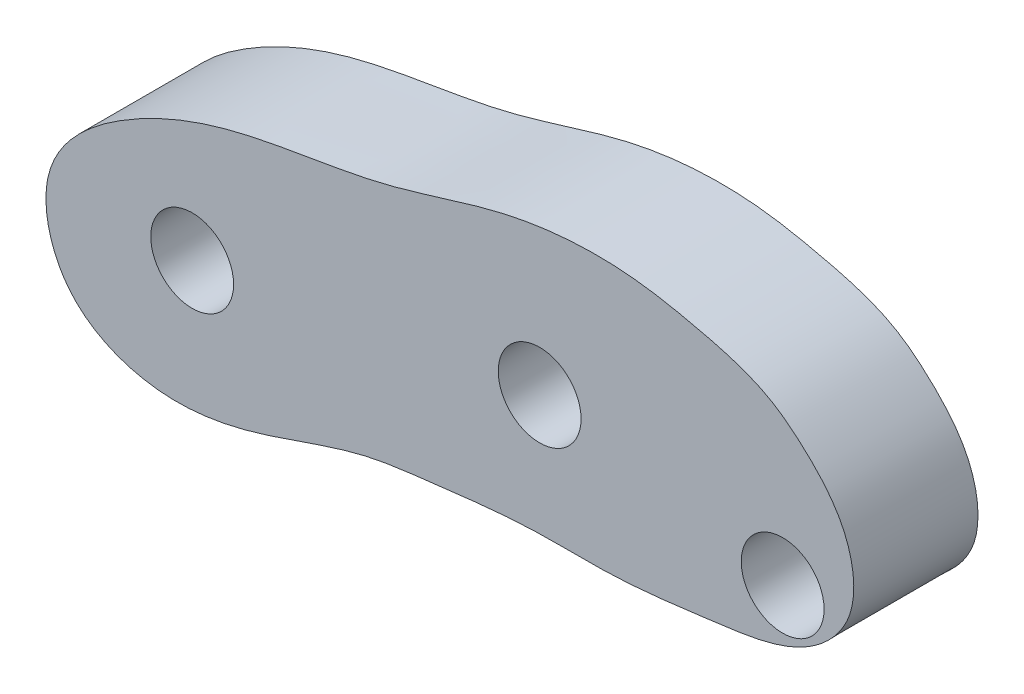
ISO-10303-21;
HEADER;
FILE_DESCRIPTION(('STEP AP214'),'2;1');
FILE_NAME('part.step','',(''),(''),'','','');
FILE_SCHEMA(('AUTOMOTIVE_DESIGN { 1 0 10303 214 1 1 1 1 }'));
ENDSEC;
DATA;
#1=APPLICATION_CONTEXT('core data for automotive mechanical design processes');
#2=APPLICATION_PROTOCOL_DEFINITION('international standard','automotive_design',2000,#1);
#3=PRODUCT_CONTEXT('',#1,'mechanical');
#4=PRODUCT('Part','Part','',(#3));
#5=PRODUCT_RELATED_PRODUCT_CATEGORY('part','',(#4));
#6=PRODUCT_DEFINITION_FORMATION('','',#4);
#7=PRODUCT_DEFINITION_CONTEXT('part definition',#1,'design');
#8=PRODUCT_DEFINITION('design','',#6,#7);
#9=PRODUCT_DEFINITION_SHAPE('','',#8);
#10=(LENGTH_UNIT() NAMED_UNIT(*) SI_UNIT(.MILLI.,.METRE.));
#11=(NAMED_UNIT(*) PLANE_ANGLE_UNIT() SI_UNIT($,.RADIAN.));
#12=(NAMED_UNIT(*) SI_UNIT($,.STERADIAN.) SOLID_ANGLE_UNIT());
#13=UNCERTAINTY_MEASURE_WITH_UNIT(LENGTH_MEASURE(1.E-05),#10,'distance_accuracy_value','');
#14=(GEOMETRIC_REPRESENTATION_CONTEXT(3) GLOBAL_UNCERTAINTY_ASSIGNED_CONTEXT((#13)) GLOBAL_UNIT_ASSIGNED_CONTEXT((#10,
#11,#12)) REPRESENTATION_CONTEXT('',''));
#15=CARTESIAN_POINT('',(0.,0.,0.));
#16=DIRECTION('',(0.,0.,1.));
#17=DIRECTION('',(1.,0.,0.));
#18=AXIS2_PLACEMENT_3D('',#15,#16,#17);
#19=CARTESIAN_POINT('',(2.38130786974085,11.6572512808231,3.));
#20=DIRECTION('',(0.,0.,1.));
#21=DIRECTION('',(1.,0.,0.));
#22=AXIS2_PLACEMENT_3D('',#19,#20,#21);
#23=PLANE('',#22);
#24=CARTESIAN_POINT('',(-5.20303399282698,11.9286291476342,3.));
#25=DIRECTION('',(0.,0.,1.));
#26=DIRECTION('',(1.,0.,0.));
#27=AXIS2_PLACEMENT_3D('',#24,#25,#26);
#28=CIRCLE('',#27,1.);
#29=CARTESIAN_POINT('',(-4.20303399282697,11.9286291476342,3.));
#30=VERTEX_POINT('',#29);
#31=EDGE_CURVE('E90',#30,#30,#28,.T.);
#32=ORIENTED_EDGE('',*,*,#31,.F.);
#33=EDGE_LOOP('',(#32));
#34=FACE_BOUND('',#33,.T.);
#35=CARTESIAN_POINT('',(-17.0747401229307,10.5462096882409,3.));
#36=CARTESIAN_POINT('',(-16.8697917913703,11.495190399688,3.));
#37=CARTESIAN_POINT('',(-15.1890375803473,12.8841945451084,3.));
#38=CARTESIAN_POINT('',(-12.3116392034365,13.9653363005591,3.));
#39=CARTESIAN_POINT('',(-9.11269658642386,14.2736370660728,3.));
#40=CARTESIAN_POINT('',(-5.98809239092924,15.4672154884498,3.));
#41=CARTESIAN_POINT('',(-3.36412085059592,15.6452678244348,3.));
#42=CARTESIAN_POINT('',(-1.2088136536674,15.1992425079085,3.));
#43=CARTESIAN_POINT('',(0.193260383925238,14.8288844683819,3.));
#44=CARTESIAN_POINT('',(1.36526609501103,13.8719138918235,3.));
#45=CARTESIAN_POINT('',(2.31666838197321,12.8083539661806,3.));
#46=CARTESIAN_POINT('',(2.52684130779453,11.0507906828682,3.));
#47=CARTESIAN_POINT('',(1.1518851741317,9.5610393349551,3.));
#48=CARTESIAN_POINT('',(-1.02647016912803,9.29783091717382,3.));
#49=CARTESIAN_POINT('',(-3.27833763877944,8.98678059701643,3.));
#50=CARTESIAN_POINT('',(-5.5579418542124,9.07595140802805,3.));
#51=CARTESIAN_POINT('',(-7.51144407818619,8.8226515013268,3.));
#52=CARTESIAN_POINT('',(-9.82392607886792,8.56849595241855,3.));
#53=CARTESIAN_POINT('',(-11.9834347086286,7.6072675304707,3.));
#54=CARTESIAN_POINT('',(-14.55088630155,7.22008490306595,3.));
#55=CARTESIAN_POINT('',(-16.8110313781361,8.1990800918358,3.));
#56=CARTESIAN_POINT('',(-17.2264452191954,9.84376332487068,3.));
#57=CARTESIAN_POINT('',(-17.0747401229307,10.5462096882409,3.));
#58=B_SPLINE_CURVE_WITH_KNOTS('',3,(#35,#36,#37,#38,#39,#40,#41,#42,#43,#44,#45,#46,#47,#48,#49,
#50,#51,#52,#53,#54,#55,#56,#57),.UNSPECIFIED.,.T.,.F.,(4,1,1,1,1,1,1,1,1,1,1,1,1,1,1,1,1,1,1,1,
4),(0.,0.0647341060027587,0.12580922284578,0.207281305339162,0.274075055569297,
0.347051231572845,0.376812323095858,0.420550281557063,0.44049444708881,0.476416641659934,
0.513364335776372,0.545183570499756,0.599503304108211,0.65312759135863,0.69720555797968,
0.749778400728776,0.78374903802129,0.850663977568499,0.905143138354099,0.952083075241524,1.),.UNSPECIFIED.);
#59=CARTESIAN_POINT('',(-17.0747401229307,10.5462096882409,3.));
#60=VERTEX_POINT('',#59);
#61=EDGE_CURVE('E11',#60,#60,#58,.T.);
#62=ORIENTED_EDGE('',*,*,#61,.F.);
#63=EDGE_LOOP('',(#62));
#64=FACE_BOUND('',#63,.T.);
#65=CARTESIAN_POINT('',(-13.5930830410716,10.5462096882409,3.));
#66=DIRECTION('',(0.,0.,1.));
#67=DIRECTION('',(1.,0.,0.));
#68=AXIS2_PLACEMENT_3D('',#65,#66,#67);
#69=CIRCLE('',#68,1.);
#70=CARTESIAN_POINT('',(-12.5930830410716,10.5462096882409,3.));
#71=VERTEX_POINT('',#70);
#72=EDGE_CURVE('E79',#71,#71,#69,.T.);
#73=ORIENTED_EDGE('',*,*,#72,.F.);
#74=EDGE_LOOP('',(#73));
#75=FACE_BOUND('',#74,.T.);
#76=CARTESIAN_POINT('',(0.664508578928438,10.8833004614541,3.));
#77=DIRECTION('',(0.,0.,1.));
#78=DIRECTION('',(1.,0.,0.));
#79=AXIS2_PLACEMENT_3D('',#76,#77,#78);
#80=CIRCLE('',#79,0.999999999999998);
#81=CARTESIAN_POINT('',(1.66450857892844,10.8833004614541,3.));
#82=VERTEX_POINT('',#81);
#83=EDGE_CURVE('E96',#82,#82,#80,.T.);
#84=ORIENTED_EDGE('',*,*,#83,.F.);
#85=EDGE_LOOP('',(#84));
#86=FACE_BOUND('',#85,.T.);
#87=ADVANCED_FACE('F66',(#34,#64,#75,#86),#23,.T.);
#88=CARTESIAN_POINT('',(2.38130786974085,11.6572512808231,0.));
#89=DIRECTION('',(0.,0.,1.));
#90=DIRECTION('',(1.,0.,0.));
#91=AXIS2_PLACEMENT_3D('',#88,#89,#90);
#92=PLANE('',#91);
#93=CARTESIAN_POINT('',(-17.0747401229307,10.5462096882409,0.));
#94=CARTESIAN_POINT('',(-16.8697917913703,11.495190399688,0.));
#95=CARTESIAN_POINT('',(-15.1890375803473,12.8841945451084,0.));
#96=CARTESIAN_POINT('',(-12.3116392034365,13.9653363005591,0.));
#97=CARTESIAN_POINT('',(-9.11269658642386,14.2736370660728,0.));
#98=CARTESIAN_POINT('',(-5.98809239092924,15.4672154884498,0.));
#99=CARTESIAN_POINT('',(-3.36412085059592,15.6452678244348,0.));
#100=CARTESIAN_POINT('',(-1.2088136536674,15.1992425079085,0.));
#101=CARTESIAN_POINT('',(0.193260383925238,14.8288844683819,0.));
#102=CARTESIAN_POINT('',(1.36526609501103,13.8719138918235,0.));
#103=CARTESIAN_POINT('',(2.31666838197321,12.8083539661806,0.));
#104=CARTESIAN_POINT('',(2.52684130779453,11.0507906828682,0.));
#105=CARTESIAN_POINT('',(1.1518851741317,9.5610393349551,0.));
#106=CARTESIAN_POINT('',(-1.02647016912803,9.29783091717382,0.));
#107=CARTESIAN_POINT('',(-3.27833763877944,8.98678059701643,0.));
#108=CARTESIAN_POINT('',(-5.5579418542124,9.07595140802805,0.));
#109=CARTESIAN_POINT('',(-7.51144407818619,8.8226515013268,0.));
#110=CARTESIAN_POINT('',(-9.82392607886792,8.56849595241855,0.));
#111=CARTESIAN_POINT('',(-11.9834347086286,7.6072675304707,0.));
#112=CARTESIAN_POINT('',(-14.55088630155,7.22008490306595,0.));
#113=CARTESIAN_POINT('',(-16.8110313781361,8.1990800918358,0.));
#114=CARTESIAN_POINT('',(-17.2264452191954,9.84376332487068,0.));
#115=CARTESIAN_POINT('',(-17.0747401229307,10.5462096882409,0.));
#116=B_SPLINE_CURVE_WITH_KNOTS('',3,(#93,#94,#95,#96,#97,#98,#99,#100,#101,#102,#103,#104,#105,
#106,#107,#108,#109,#110,#111,#112,#113,#114,#115),.UNSPECIFIED.,.T.,.F.,(4,1,1,1,1,1,1,1,1,1,1,
1,1,1,1,1,1,1,1,1,4),(0.,0.0647341060027587,0.12580922284578,0.207281305339162,
0.274075055569297,0.347051231572845,0.376812323095858,0.420550281557063,0.44049444708881,
0.476416641659934,0.513364335776372,0.545183570499756,0.599503304108211,0.65312759135863,
0.69720555797968,0.749778400728776,0.78374903802129,0.850663977568499,0.905143138354099,
0.952083075241524,1.),.UNSPECIFIED.);
#117=CARTESIAN_POINT('',(-17.0747401229307,10.5462096882409,0.));
#118=VERTEX_POINT('',#117);
#119=EDGE_CURVE('E71',#118,#118,#116,.T.);
#120=ORIENTED_EDGE('',*,*,#119,.T.);
#121=EDGE_LOOP('',(#120));
#122=FACE_BOUND('',#121,.T.);
#123=CARTESIAN_POINT('',(-13.5930830410716,10.5462096882409,0.));
#124=DIRECTION('',(0.,0.,1.));
#125=DIRECTION('',(1.,0.,0.));
#126=AXIS2_PLACEMENT_3D('',#123,#124,#125);
#127=CIRCLE('',#126,1.);
#128=CARTESIAN_POINT('',(-12.5930830410716,10.5462096882409,0.));
#129=VERTEX_POINT('',#128);
#130=EDGE_CURVE('E84',#129,#129,#127,.T.);
#131=ORIENTED_EDGE('',*,*,#130,.T.);
#132=EDGE_LOOP('',(#131));
#133=FACE_BOUND('',#132,.T.);
#134=CARTESIAN_POINT('',(-5.20303399282698,11.9286291476342,0.));
#135=DIRECTION('',(0.,0.,1.));
#136=DIRECTION('',(1.,0.,0.));
#137=AXIS2_PLACEMENT_3D('',#134,#135,#136);
#138=CIRCLE('',#137,1.);
#139=CARTESIAN_POINT('',(-4.20303399282697,11.9286291476342,0.));
#140=VERTEX_POINT('',#139);
#141=EDGE_CURVE('E93',#140,#140,#138,.T.);
#142=ORIENTED_EDGE('',*,*,#141,.T.);
#143=EDGE_LOOP('',(#142));
#144=FACE_BOUND('',#143,.T.);
#145=CARTESIAN_POINT('',(0.664508578928438,10.8833004614541,0.));
#146=DIRECTION('',(0.,0.,1.));
#147=DIRECTION('',(1.,0.,0.));
#148=AXIS2_PLACEMENT_3D('',#145,#146,#147);
#149=CIRCLE('',#148,0.999999999999998);
#150=CARTESIAN_POINT('',(1.66450857892844,10.8833004614541,0.));
#151=VERTEX_POINT('',#150);
#152=EDGE_CURVE('E99',#151,#151,#149,.T.);
#153=ORIENTED_EDGE('',*,*,#152,.T.);
#154=EDGE_LOOP('',(#153));
#155=FACE_BOUND('',#154,.T.);
#156=ADVANCED_FACE('F109',(#122,#133,#144,#155),#92,.F.);
#157=DIRECTION('',(0.,0.,-1.));
#158=VECTOR('',#157,1.);
#159=SURFACE_OF_LINEAR_EXTRUSION('',#58,#158);
#160=ORIENTED_EDGE('',*,*,#61,.T.);
#161=EDGE_LOOP('',(#160));
#162=FACE_BOUND('',#161,.T.);
#163=ORIENTED_EDGE('',*,*,#119,.F.);
#164=EDGE_LOOP('',(#163));
#165=FACE_BOUND('',#164,.T.);
#166=ADVANCED_FACE('F68',(#162,#165),#159,.T.);
#167=CARTESIAN_POINT('',(-13.5930830410716,10.5462096882409,3.));
#168=DIRECTION('',(0.,0.,-1.));
#169=DIRECTION('',(-1.,0.,0.));
#170=AXIS2_PLACEMENT_3D('',#167,#168,#169);
#171=CYLINDRICAL_SURFACE('',#170,1.);
#172=ORIENTED_EDGE('',*,*,#72,.T.);
#173=EDGE_LOOP('',(#172));
#174=FACE_BOUND('',#173,.T.);
#175=ORIENTED_EDGE('',*,*,#130,.F.);
#176=EDGE_LOOP('',(#175));
#177=FACE_BOUND('',#176,.T.);
#178=ADVANCED_FACE('F119',(#174,#177),#171,.F.);
#179=CARTESIAN_POINT('',(-5.20303399282698,11.9286291476342,3.));
#180=DIRECTION('',(0.,0.,-1.));
#181=DIRECTION('',(-1.,0.,0.));
#182=AXIS2_PLACEMENT_3D('',#179,#180,#181);
#183=CYLINDRICAL_SURFACE('',#182,1.);
#184=ORIENTED_EDGE('',*,*,#31,.T.);
#185=EDGE_LOOP('',(#184));
#186=FACE_BOUND('',#185,.T.);
#187=ORIENTED_EDGE('',*,*,#141,.F.);
#188=EDGE_LOOP('',(#187));
#189=FACE_BOUND('',#188,.T.);
#190=ADVANCED_FACE('F122',(#186,#189),#183,.F.);
#191=CARTESIAN_POINT('',(0.664508578928438,10.8833004614541,3.));
#192=DIRECTION('',(0.,0.,-1.));
#193=DIRECTION('',(-1.,0.,0.));
#194=AXIS2_PLACEMENT_3D('',#191,#192,#193);
#195=CYLINDRICAL_SURFACE('',#194,0.999999999999998);
#196=ORIENTED_EDGE('',*,*,#83,.T.);
#197=EDGE_LOOP('',(#196));
#198=FACE_BOUND('',#197,.T.);
#199=ORIENTED_EDGE('',*,*,#152,.F.);
#200=EDGE_LOOP('',(#199));
#201=FACE_BOUND('',#200,.T.);
#202=ADVANCED_FACE('F105',(#198,#201),#195,.F.);
#203=CLOSED_SHELL('',(#87,#156,#166,#178,#190,#202));
#204=MANIFOLD_SOLID_BREP('B2',#203);
#205=ADVANCED_BREP_SHAPE_REPRESENTATION('',(#18,#204),#14);
#206=SHAPE_DEFINITION_REPRESENTATION(#9,#205);
ENDSEC;
END-ISO-10303-21;
